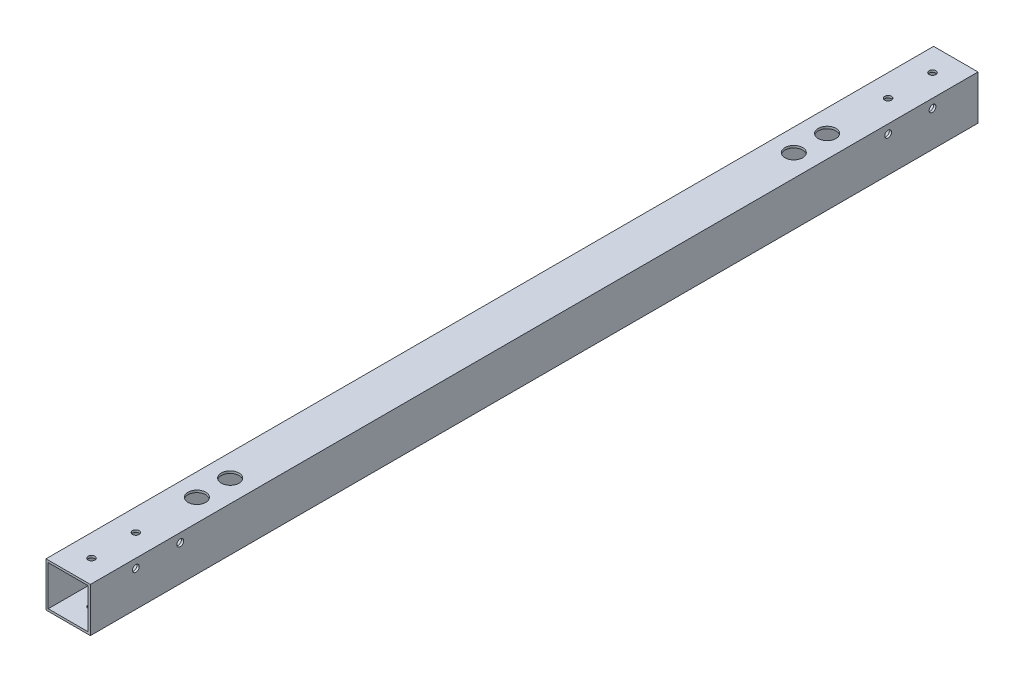
ISO-10303-21;
HEADER;
FILE_DESCRIPTION(('STEP AP214'),'2;1');
FILE_NAME('part.step','',(''),(''),'','','');
FILE_SCHEMA(('AUTOMOTIVE_DESIGN { 1 0 10303 214 1 1 1 1 }'));
ENDSEC;
DATA;
#1=APPLICATION_CONTEXT('core data for automotive mechanical design processes');
#2=APPLICATION_PROTOCOL_DEFINITION('international standard','automotive_design',2000,#1);
#3=PRODUCT_CONTEXT('',#1,'mechanical');
#4=PRODUCT('Part','Part','',(#3));
#5=PRODUCT_RELATED_PRODUCT_CATEGORY('part','',(#4));
#6=PRODUCT_DEFINITION_FORMATION('','',#4);
#7=PRODUCT_DEFINITION_CONTEXT('part definition',#1,'design');
#8=PRODUCT_DEFINITION('design','',#6,#7);
#9=PRODUCT_DEFINITION_SHAPE('','',#8);
#10=(LENGTH_UNIT() NAMED_UNIT(*) SI_UNIT(.MILLI.,.METRE.));
#11=(NAMED_UNIT(*) PLANE_ANGLE_UNIT() SI_UNIT($,.RADIAN.));
#12=(NAMED_UNIT(*) SI_UNIT($,.STERADIAN.) SOLID_ANGLE_UNIT());
#13=UNCERTAINTY_MEASURE_WITH_UNIT(LENGTH_MEASURE(1.E-05),#10,'distance_accuracy_value','');
#14=(GEOMETRIC_REPRESENTATION_CONTEXT(3) GLOBAL_UNCERTAINTY_ASSIGNED_CONTEXT((#13)) GLOBAL_UNIT_ASSIGNED_CONTEXT((#10,
#11,#12)) REPRESENTATION_CONTEXT('',''));
#15=CARTESIAN_POINT('',(0.,0.,0.));
#16=DIRECTION('',(0.,0.,1.));
#17=DIRECTION('',(1.,0.,0.));
#18=AXIS2_PLACEMENT_3D('',#15,#16,#17);
#19=CARTESIAN_POINT('',(10.,-10.,200.));
#20=DIRECTION('',(-1.,0.,0.));
#21=DIRECTION('',(0.,0.,1.));
#22=AXIS2_PLACEMENT_3D('',#19,#20,#21);
#23=PLANE('',#22);
#24=CARTESIAN_POINT('',(10.,5.99999999999989,-179.500000000004));
#25=DIRECTION('',(-1.,0.,0.));
#26=DIRECTION('',(0.,0.,1.));
#27=AXIS2_PLACEMENT_3D('',#24,#25,#26);
#28=CIRCLE('',#27,1.52500000000383);
#29=CARTESIAN_POINT('',(10.,5.99999999999989,-177.975));
#30=VERTEX_POINT('',#29);
#31=EDGE_CURVE('E216',#30,#30,#28,.T.);
#32=ORIENTED_EDGE('',*,*,#31,.T.);
#33=EDGE_LOOP('',(#32));
#34=FACE_BOUND('',#33,.T.);
#35=CARTESIAN_POINT('',(10.,5.99999999999989,-159.500000000004));
#36=DIRECTION('',(-1.,0.,0.));
#37=DIRECTION('',(0.,0.,1.));
#38=AXIS2_PLACEMENT_3D('',#35,#36,#37);
#39=CIRCLE('',#38,1.52500000000383);
#40=CARTESIAN_POINT('',(10.,5.99999999999989,-157.975));
#41=VERTEX_POINT('',#40);
#42=EDGE_CURVE('E226',#41,#41,#39,.T.);
#43=ORIENTED_EDGE('',*,*,#42,.T.);
#44=EDGE_LOOP('',(#43));
#45=FACE_BOUND('',#44,.T.);
#46=CARTESIAN_POINT('',(10.,5.99999999999989,179.500000000004));
#47=DIRECTION('',(1.,0.,0.));
#48=DIRECTION('',(0.,0.,-1.));
#49=AXIS2_PLACEMENT_3D('',#46,#47,#48);
#50=CIRCLE('',#49,1.52500000000383);
#51=CARTESIAN_POINT('',(10.,5.99999999999989,177.975));
#52=VERTEX_POINT('',#51);
#53=EDGE_CURVE('E267',#52,#52,#50,.T.);
#54=ORIENTED_EDGE('',*,*,#53,.F.);
#55=EDGE_LOOP('',(#54));
#56=FACE_BOUND('',#55,.T.);
#57=CARTESIAN_POINT('',(10.,5.99999999999989,159.500000000004));
#58=DIRECTION('',(1.,0.,0.));
#59=DIRECTION('',(0.,0.,-1.));
#60=AXIS2_PLACEMENT_3D('',#57,#58,#59);
#61=CIRCLE('',#60,1.52500000000383);
#62=CARTESIAN_POINT('',(10.,5.99999999999989,157.975));
#63=VERTEX_POINT('',#62);
#64=EDGE_CURVE('E270',#63,#63,#61,.T.);
#65=ORIENTED_EDGE('',*,*,#64,.F.);
#66=EDGE_LOOP('',(#65));
#67=FACE_BOUND('',#66,.T.);
#68=DIRECTION('',(0.,1.,0.));
#69=VECTOR('',#68,1.);
#70=CARTESIAN_POINT('',(10.,-10.,-200.));
#71=LINE('',#70,#69);
#72=CARTESIAN_POINT('',(10.,-10.,-200.));
#73=VERTEX_POINT('',#72);
#74=CARTESIAN_POINT('',(10.,10.,-200.));
#75=VERTEX_POINT('',#74);
#76=EDGE_CURVE('E135',#73,#75,#71,.T.);
#77=ORIENTED_EDGE('',*,*,#76,.T.);
#78=DIRECTION('',(0.,0.,-1.));
#79=VECTOR('',#78,1.);
#80=CARTESIAN_POINT('',(10.,10.,200.));
#81=LINE('',#80,#79);
#82=CARTESIAN_POINT('',(10.,10.,200.));
#83=VERTEX_POINT('',#82);
#84=EDGE_CURVE('E11',#83,#75,#81,.T.);
#85=ORIENTED_EDGE('',*,*,#84,.F.);
#86=DIRECTION('',(0.,1.,0.));
#87=VECTOR('',#86,1.);
#88=CARTESIAN_POINT('',(10.,-10.,200.));
#89=LINE('',#88,#87);
#90=CARTESIAN_POINT('',(10.,-10.,200.));
#91=VERTEX_POINT('',#90);
#92=EDGE_CURVE('E138',#91,#83,#89,.T.);
#93=ORIENTED_EDGE('',*,*,#92,.F.);
#94=DIRECTION('',(0.,0.,-1.));
#95=VECTOR('',#94,1.);
#96=CARTESIAN_POINT('',(10.,-10.,200.));
#97=LINE('',#96,#95);
#98=EDGE_CURVE('E148',#91,#73,#97,.T.);
#99=ORIENTED_EDGE('',*,*,#98,.T.);
#100=EDGE_LOOP('',(#77,#85,#93,#99));
#101=FACE_BOUND('',#100,.T.);
#102=ADVANCED_FACE('F35',(#34,#45,#56,#67,#101),#23,.F.);
#103=CARTESIAN_POINT('',(-9.99999999999999,10.,200.));
#104=DIRECTION('',(0.,-1.,0.));
#105=DIRECTION('',(0.,0.,-1.));
#106=AXIS2_PLACEMENT_3D('',#103,#104,#105);
#107=PLANE('',#106);
#108=CARTESIAN_POINT('',(0.,10.,-127.));
#109=DIRECTION('',(0.,-1.,0.));
#110=DIRECTION('',(0.,0.,-1.));
#111=AXIS2_PLACEMENT_3D('',#108,#109,#110);
#112=CIRCLE('',#111,4.);
#113=CARTESIAN_POINT('',(0.,10.,-131.));
#114=VERTEX_POINT('',#113);
#115=EDGE_CURVE('E204',#114,#114,#112,.T.);
#116=ORIENTED_EDGE('',*,*,#115,.T.);
#117=EDGE_LOOP('',(#116));
#118=FACE_BOUND('',#117,.T.);
#119=CARTESIAN_POINT('',(0.,10.,-142.));
#120=DIRECTION('',(0.,-1.,0.));
#121=DIRECTION('',(0.,0.,-1.));
#122=AXIS2_PLACEMENT_3D('',#119,#120,#121);
#123=CIRCLE('',#122,4.);
#124=CARTESIAN_POINT('',(0.,10.,-146.));
#125=VERTEX_POINT('',#124);
#126=EDGE_CURVE('E232',#125,#125,#123,.T.);
#127=ORIENTED_EDGE('',*,*,#126,.T.);
#128=EDGE_LOOP('',(#127));
#129=FACE_BOUND('',#128,.T.);
#130=CARTESIAN_POINT('',(0.,10.,127.));
#131=DIRECTION('',(0.,1.,0.));
#132=DIRECTION('',(0.,0.,1.));
#133=AXIS2_PLACEMENT_3D('',#130,#131,#132);
#134=CIRCLE('',#133,4.);
#135=CARTESIAN_POINT('',(0.,10.,131.));
#136=VERTEX_POINT('',#135);
#137=EDGE_CURVE('E196',#136,#136,#134,.T.);
#138=ORIENTED_EDGE('',*,*,#137,.F.);
#139=EDGE_LOOP('',(#138));
#140=FACE_BOUND('',#139,.T.);
#141=CARTESIAN_POINT('',(0.,10.,142.));
#142=DIRECTION('',(0.,1.,0.));
#143=DIRECTION('',(0.,0.,1.));
#144=AXIS2_PLACEMENT_3D('',#141,#142,#143);
#145=CIRCLE('',#144,4.);
#146=CARTESIAN_POINT('',(0.,10.,146.));
#147=VERTEX_POINT('',#146);
#148=EDGE_CURVE('E248',#147,#147,#145,.T.);
#149=ORIENTED_EDGE('',*,*,#148,.F.);
#150=EDGE_LOOP('',(#149));
#151=FACE_BOUND('',#150,.T.);
#152=CARTESIAN_POINT('',(0.,10.,-189.5));
#153=DIRECTION('',(0.,-1.,0.));
#154=DIRECTION('',(0.,0.,-1.));
#155=AXIS2_PLACEMENT_3D('',#152,#153,#154);
#156=CIRCLE('',#155,1.52500000000002);
#157=CARTESIAN_POINT('',(0.,10.,-191.025));
#158=VERTEX_POINT('',#157);
#159=EDGE_CURVE('E290',#158,#158,#156,.F.);
#160=ORIENTED_EDGE('',*,*,#159,.F.);
#161=EDGE_LOOP('',(#160));
#162=FACE_BOUND('',#161,.T.);
#163=CARTESIAN_POINT('',(0.,10.,-169.5));
#164=DIRECTION('',(0.,-1.,0.));
#165=DIRECTION('',(0.,0.,-1.));
#166=AXIS2_PLACEMENT_3D('',#163,#164,#165);
#167=CIRCLE('',#166,1.52500000000002);
#168=CARTESIAN_POINT('',(0.,10.,-171.025));
#169=VERTEX_POINT('',#168);
#170=EDGE_CURVE('E182',#169,#169,#167,.F.);
#171=ORIENTED_EDGE('',*,*,#170,.F.);
#172=EDGE_LOOP('',(#171));
#173=FACE_BOUND('',#172,.T.);
#174=CARTESIAN_POINT('',(0.,10.,189.5));
#175=DIRECTION('',(0.,-1.,0.));
#176=DIRECTION('',(0.,0.,-1.));
#177=AXIS2_PLACEMENT_3D('',#174,#175,#176);
#178=CIRCLE('',#177,1.52500000000002);
#179=CARTESIAN_POINT('',(0.,10.,187.975));
#180=VERTEX_POINT('',#179);
#181=EDGE_CURVE('E304',#180,#180,#178,.T.);
#182=ORIENTED_EDGE('',*,*,#181,.T.);
#183=EDGE_LOOP('',(#182));
#184=FACE_BOUND('',#183,.T.);
#185=CARTESIAN_POINT('',(0.,10.,169.5));
#186=DIRECTION('',(0.,-1.,0.));
#187=DIRECTION('',(0.,0.,-1.));
#188=AXIS2_PLACEMENT_3D('',#185,#186,#187);
#189=CIRCLE('',#188,1.52500000000002);
#190=CARTESIAN_POINT('',(0.,10.,167.975));
#191=VERTEX_POINT('',#190);
#192=EDGE_CURVE('E172',#191,#191,#189,.T.);
#193=ORIENTED_EDGE('',*,*,#192,.T.);
#194=EDGE_LOOP('',(#193));
#195=FACE_BOUND('',#194,.T.);
#196=DIRECTION('',(-1.,0.,0.));
#197=VECTOR('',#196,1.);
#198=CARTESIAN_POINT('',(-9.99999999999999,10.,-200.));
#199=LINE('',#198,#197);
#200=CARTESIAN_POINT('',(-9.99999999999999,10.,-200.));
#201=VERTEX_POINT('',#200);
#202=EDGE_CURVE('E151',#75,#201,#199,.T.);
#203=ORIENTED_EDGE('',*,*,#202,.T.);
#204=DIRECTION('',(0.,0.,-1.));
#205=VECTOR('',#204,1.);
#206=CARTESIAN_POINT('',(-9.99999999999999,10.,200.));
#207=LINE('',#206,#205);
#208=CARTESIAN_POINT('',(-9.99999999999999,10.,200.));
#209=VERTEX_POINT('',#208);
#210=EDGE_CURVE('E43',#209,#201,#207,.T.);
#211=ORIENTED_EDGE('',*,*,#210,.F.);
#212=DIRECTION('',(-1.,0.,0.));
#213=VECTOR('',#212,1.);
#214=CARTESIAN_POINT('',(-9.99999999999999,10.,200.));
#215=LINE('',#214,#213);
#216=EDGE_CURVE('E141',#83,#209,#215,.T.);
#217=ORIENTED_EDGE('',*,*,#216,.F.);
#218=ORIENTED_EDGE('',*,*,#84,.T.);
#219=EDGE_LOOP('',(#203,#211,#217,#218));
#220=FACE_BOUND('',#219,.T.);
#221=ADVANCED_FACE('F308',(#118,#129,#140,#151,#162,#173,#184,#195,#220),#107,.F.);
#222=CARTESIAN_POINT('',(-9.99999999999999,-10.,200.));
#223=DIRECTION('',(1.,0.,0.));
#224=DIRECTION('',(0.,0.,-1.));
#225=AXIS2_PLACEMENT_3D('',#222,#223,#224);
#226=PLANE('',#225);
#227=CARTESIAN_POINT('',(-9.99999999999999,5.99999999999989,-179.500000000004));
#228=DIRECTION('',(-1.,0.,0.));
#229=DIRECTION('',(0.,0.,1.));
#230=AXIS2_PLACEMENT_3D('',#227,#228,#229);
#231=CIRCLE('',#230,1.52500000000383);
#232=CARTESIAN_POINT('',(-9.99999999999999,5.99999999999989,-177.975));
#233=VERTEX_POINT('',#232);
#234=EDGE_CURVE('E210',#233,#233,#231,.T.);
#235=ORIENTED_EDGE('',*,*,#234,.F.);
#236=EDGE_LOOP('',(#235));
#237=FACE_BOUND('',#236,.T.);
#238=CARTESIAN_POINT('',(-9.99999999999999,5.99999999999989,-159.500000000004));
#239=DIRECTION('',(-1.,0.,0.));
#240=DIRECTION('',(0.,0.,1.));
#241=AXIS2_PLACEMENT_3D('',#238,#239,#240);
#242=CIRCLE('',#241,1.52500000000383);
#243=CARTESIAN_POINT('',(-9.99999999999999,5.99999999999989,-157.975));
#244=VERTEX_POINT('',#243);
#245=EDGE_CURVE('E221',#244,#244,#242,.T.);
#246=ORIENTED_EDGE('',*,*,#245,.F.);
#247=EDGE_LOOP('',(#246));
#248=FACE_BOUND('',#247,.T.);
#249=CARTESIAN_POINT('',(-9.99999999999999,5.99999999999989,179.500000000004));
#250=DIRECTION('',(1.,0.,0.));
#251=DIRECTION('',(0.,0.,-1.));
#252=AXIS2_PLACEMENT_3D('',#249,#250,#251);
#253=CIRCLE('',#252,1.52500000000383);
#254=CARTESIAN_POINT('',(-9.99999999999999,5.99999999999989,177.975));
#255=VERTEX_POINT('',#254);
#256=EDGE_CURVE('E187',#255,#255,#253,.T.);
#257=ORIENTED_EDGE('',*,*,#256,.T.);
#258=EDGE_LOOP('',(#257));
#259=FACE_BOUND('',#258,.T.);
#260=CARTESIAN_POINT('',(-9.99999999999999,5.99999999999989,159.500000000004));
#261=DIRECTION('',(1.,0.,0.));
#262=DIRECTION('',(0.,0.,-1.));
#263=AXIS2_PLACEMENT_3D('',#260,#261,#262);
#264=CIRCLE('',#263,1.52500000000383);
#265=CARTESIAN_POINT('',(-9.99999999999999,5.99999999999989,157.975));
#266=VERTEX_POINT('',#265);
#267=EDGE_CURVE('E264',#266,#266,#264,.T.);
#268=ORIENTED_EDGE('',*,*,#267,.T.);
#269=EDGE_LOOP('',(#268));
#270=FACE_BOUND('',#269,.T.);
#271=DIRECTION('',(0.,-1.,0.));
#272=VECTOR('',#271,1.);
#273=CARTESIAN_POINT('',(-9.99999999999999,-10.,-200.));
#274=LINE('',#273,#272);
#275=CARTESIAN_POINT('',(-9.99999999999999,-10.,-200.));
#276=VERTEX_POINT('',#275);
#277=EDGE_CURVE('E153',#201,#276,#274,.T.);
#278=ORIENTED_EDGE('',*,*,#277,.T.);
#279=DIRECTION('',(0.,0.,-1.));
#280=VECTOR('',#279,1.);
#281=CARTESIAN_POINT('',(-9.99999999999999,-10.,200.));
#282=LINE('',#281,#280);
#283=CARTESIAN_POINT('',(-9.99999999999999,-10.,200.));
#284=VERTEX_POINT('',#283);
#285=EDGE_CURVE('E158',#284,#276,#282,.T.);
#286=ORIENTED_EDGE('',*,*,#285,.F.);
#287=DIRECTION('',(0.,-1.,0.));
#288=VECTOR('',#287,1.);
#289=CARTESIAN_POINT('',(-9.99999999999999,-10.,200.));
#290=LINE('',#289,#288);
#291=EDGE_CURVE('E144',#209,#284,#290,.T.);
#292=ORIENTED_EDGE('',*,*,#291,.F.);
#293=ORIENTED_EDGE('',*,*,#210,.T.);
#294=EDGE_LOOP('',(#278,#286,#292,#293));
#295=FACE_BOUND('',#294,.T.);
#296=ADVANCED_FACE('F335',(#237,#248,#259,#270,#295),#226,.F.);
#297=CARTESIAN_POINT('',(-9.99999999999999,-10.,200.));
#298=DIRECTION('',(0.,1.,0.));
#299=DIRECTION('',(0.,0.,1.));
#300=AXIS2_PLACEMENT_3D('',#297,#298,#299);
#301=PLANE('',#300);
#302=CARTESIAN_POINT('',(0.,-10.,-142.));
#303=DIRECTION('',(0.,1.,0.));
#304=DIRECTION('',(0.,0.,1.));
#305=AXIS2_PLACEMENT_3D('',#302,#303,#304);
#306=CIRCLE('',#305,2.025);
#307=CARTESIAN_POINT('',(0.,-10.,-139.975));
#308=VERTEX_POINT('',#307);
#309=EDGE_CURVE('E237',#308,#308,#306,.T.);
#310=ORIENTED_EDGE('',*,*,#309,.T.);
#311=EDGE_LOOP('',(#310));
#312=FACE_BOUND('',#311,.T.);
#313=CARTESIAN_POINT('',(0.,-10.,-127.));
#314=DIRECTION('',(0.,1.,0.));
#315=DIRECTION('',(0.,0.,1.));
#316=AXIS2_PLACEMENT_3D('',#313,#314,#315);
#317=CIRCLE('',#316,2.025);
#318=CARTESIAN_POINT('',(0.,-10.,-124.975));
#319=VERTEX_POINT('',#318);
#320=EDGE_CURVE('E206',#319,#319,#317,.T.);
#321=ORIENTED_EDGE('',*,*,#320,.T.);
#322=EDGE_LOOP('',(#321));
#323=FACE_BOUND('',#322,.T.);
#324=CARTESIAN_POINT('',(0.,-10.,142.));
#325=DIRECTION('',(0.,-1.,0.));
#326=DIRECTION('',(0.,0.,-1.));
#327=AXIS2_PLACEMENT_3D('',#324,#325,#326);
#328=CIRCLE('',#327,2.025);
#329=CARTESIAN_POINT('',(0.,-10.,139.975));
#330=VERTEX_POINT('',#329);
#331=EDGE_CURVE('E253',#330,#330,#328,.T.);
#332=ORIENTED_EDGE('',*,*,#331,.F.);
#333=EDGE_LOOP('',(#332));
#334=FACE_BOUND('',#333,.T.);
#335=CARTESIAN_POINT('',(0.,-10.,127.));
#336=DIRECTION('',(0.,-1.,0.));
#337=DIRECTION('',(0.,0.,-1.));
#338=AXIS2_PLACEMENT_3D('',#335,#336,#337);
#339=CIRCLE('',#338,2.025);
#340=CARTESIAN_POINT('',(0.,-10.,124.975));
#341=VERTEX_POINT('',#340);
#342=EDGE_CURVE('E199',#341,#341,#339,.T.);
#343=ORIENTED_EDGE('',*,*,#342,.F.);
#344=EDGE_LOOP('',(#343));
#345=FACE_BOUND('',#344,.T.);
#346=CARTESIAN_POINT('',(0.,-10.,-189.5));
#347=DIRECTION('',(0.,-1.,0.));
#348=DIRECTION('',(0.,0.,-1.));
#349=AXIS2_PLACEMENT_3D('',#346,#347,#348);
#350=CIRCLE('',#349,1.52500000000002);
#351=CARTESIAN_POINT('',(0.,-10.,-191.025));
#352=VERTEX_POINT('',#351);
#353=EDGE_CURVE('E177',#352,#352,#350,.T.);
#354=ORIENTED_EDGE('',*,*,#353,.F.);
#355=EDGE_LOOP('',(#354));
#356=FACE_BOUND('',#355,.T.);
#357=CARTESIAN_POINT('',(0.,-10.,-169.5));
#358=DIRECTION('',(0.,-1.,0.));
#359=DIRECTION('',(0.,0.,-1.));
#360=AXIS2_PLACEMENT_3D('',#357,#358,#359);
#361=CIRCLE('',#360,1.52500000000002);
#362=CARTESIAN_POINT('',(0.,-10.,-171.025));
#363=VERTEX_POINT('',#362);
#364=EDGE_CURVE('E279',#363,#363,#361,.T.);
#365=ORIENTED_EDGE('',*,*,#364,.F.);
#366=EDGE_LOOP('',(#365));
#367=FACE_BOUND('',#366,.T.);
#368=CARTESIAN_POINT('',(0.,-10.,189.5));
#369=DIRECTION('',(0.,1.,0.));
#370=DIRECTION('',(0.,0.,1.));
#371=AXIS2_PLACEMENT_3D('',#368,#369,#370);
#372=CIRCLE('',#371,1.52500000000002);
#373=CARTESIAN_POINT('',(0.,-10.,191.025));
#374=VERTEX_POINT('',#373);
#375=EDGE_CURVE('E167',#374,#374,#372,.T.);
#376=ORIENTED_EDGE('',*,*,#375,.T.);
#377=EDGE_LOOP('',(#376));
#378=FACE_BOUND('',#377,.T.);
#379=CARTESIAN_POINT('',(0.,-10.,169.5));
#380=DIRECTION('',(0.,1.,0.));
#381=DIRECTION('',(0.,0.,1.));
#382=AXIS2_PLACEMENT_3D('',#379,#380,#381);
#383=CIRCLE('',#382,1.52500000000002);
#384=CARTESIAN_POINT('',(0.,-10.,171.025));
#385=VERTEX_POINT('',#384);
#386=EDGE_CURVE('E293',#385,#385,#383,.T.);
#387=ORIENTED_EDGE('',*,*,#386,.T.);
#388=EDGE_LOOP('',(#387));
#389=FACE_BOUND('',#388,.T.);
#390=DIRECTION('',(1.,0.,0.));
#391=VECTOR('',#390,1.);
#392=CARTESIAN_POINT('',(-9.99999999999999,-10.,-200.));
#393=LINE('',#392,#391);
#394=EDGE_CURVE('E142',#276,#73,#393,.T.);
#395=ORIENTED_EDGE('',*,*,#394,.T.);
#396=ORIENTED_EDGE('',*,*,#98,.F.);
#397=DIRECTION('',(1.,0.,0.));
#398=VECTOR('',#397,1.);
#399=CARTESIAN_POINT('',(-9.99999999999999,-10.,200.));
#400=LINE('',#399,#398);
#401=EDGE_CURVE('E146',#284,#91,#400,.T.);
#402=ORIENTED_EDGE('',*,*,#401,.F.);
#403=ORIENTED_EDGE('',*,*,#285,.T.);
#404=EDGE_LOOP('',(#395,#396,#402,#403));
#405=FACE_BOUND('',#404,.T.);
#406=ADVANCED_FACE('F359',(#312,#323,#334,#345,#356,#367,#378,#389,#405),#301,.F.);
#407=CARTESIAN_POINT('',(0.,0.,200.));
#408=DIRECTION('',(0.,0.,-1.));
#409=DIRECTION('',(-1.,0.,0.));
#410=AXIS2_PLACEMENT_3D('',#407,#408,#409);
#411=PLANE('',#410);
#412=DIRECTION('',(0.,1.,0.));
#413=VECTOR('',#412,1.);
#414=CARTESIAN_POINT('',(9.00000000000001,-9.,200.));
#415=LINE('',#414,#413);
#416=CARTESIAN_POINT('',(9.00000000000001,-9.,200.));
#417=VERTEX_POINT('',#416);
#418=CARTESIAN_POINT('',(9.00000000000001,9.,200.));
#419=VERTEX_POINT('',#418);
#420=EDGE_CURVE('E112',#417,#419,#415,.T.);
#421=ORIENTED_EDGE('',*,*,#420,.F.);
#422=DIRECTION('',(1.,0.,0.));
#423=VECTOR('',#422,1.);
#424=CARTESIAN_POINT('',(-8.99999999999999,-9.,200.));
#425=LINE('',#424,#423);
#426=CARTESIAN_POINT('',(-8.99999999999999,-9.,200.));
#427=VERTEX_POINT('',#426);
#428=EDGE_CURVE('E51',#427,#417,#425,.T.);
#429=ORIENTED_EDGE('',*,*,#428,.F.);
#430=DIRECTION('',(0.,-1.,0.));
#431=VECTOR('',#430,1.);
#432=CARTESIAN_POINT('',(-8.99999999999999,9.,200.));
#433=LINE('',#432,#431);
#434=CARTESIAN_POINT('',(-8.99999999999999,9.,200.));
#435=VERTEX_POINT('',#434);
#436=EDGE_CURVE('E119',#435,#427,#433,.T.);
#437=ORIENTED_EDGE('',*,*,#436,.F.);
#438=DIRECTION('',(-1.,0.,0.));
#439=VECTOR('',#438,1.);
#440=CARTESIAN_POINT('',(9.00000000000001,9.,200.));
#441=LINE('',#440,#439);
#442=EDGE_CURVE('E103',#419,#435,#441,.T.);
#443=ORIENTED_EDGE('',*,*,#442,.F.);
#444=EDGE_LOOP('',(#421,#429,#437,#443));
#445=FACE_BOUND('',#444,.T.);
#446=ORIENTED_EDGE('',*,*,#92,.T.);
#447=ORIENTED_EDGE('',*,*,#216,.T.);
#448=ORIENTED_EDGE('',*,*,#291,.T.);
#449=ORIENTED_EDGE('',*,*,#401,.T.);
#450=EDGE_LOOP('',(#446,#447,#448,#449));
#451=FACE_BOUND('',#450,.T.);
#452=ADVANCED_FACE('F116',(#445,#451),#411,.F.);
#453=CARTESIAN_POINT('',(0.,0.,-200.));
#454=DIRECTION('',(0.,0.,-1.));
#455=DIRECTION('',(-1.,0.,0.));
#456=AXIS2_PLACEMENT_3D('',#453,#454,#455);
#457=PLANE('',#456);
#458=DIRECTION('',(1.,0.,0.));
#459=VECTOR('',#458,1.);
#460=CARTESIAN_POINT('',(-8.99999999999999,-9.,-200.));
#461=LINE('',#460,#459);
#462=CARTESIAN_POINT('',(-8.99999999999999,-9.,-200.));
#463=VERTEX_POINT('',#462);
#464=CARTESIAN_POINT('',(9.00000000000001,-9.,-200.));
#465=VERTEX_POINT('',#464);
#466=EDGE_CURVE('E121',#463,#465,#461,.T.);
#467=ORIENTED_EDGE('',*,*,#466,.T.);
#468=DIRECTION('',(0.,1.,0.));
#469=VECTOR('',#468,1.);
#470=CARTESIAN_POINT('',(9.00000000000001,-9.,-200.));
#471=LINE('',#470,#469);
#472=CARTESIAN_POINT('',(9.00000000000001,9.,-200.));
#473=VERTEX_POINT('',#472);
#474=EDGE_CURVE('E127',#465,#473,#471,.T.);
#475=ORIENTED_EDGE('',*,*,#474,.T.);
#476=DIRECTION('',(-1.,0.,0.));
#477=VECTOR('',#476,1.);
#478=CARTESIAN_POINT('',(9.00000000000001,9.,-200.));
#479=LINE('',#478,#477);
#480=CARTESIAN_POINT('',(-8.99999999999999,9.,-200.));
#481=VERTEX_POINT('',#480);
#482=EDGE_CURVE('E59',#473,#481,#479,.T.);
#483=ORIENTED_EDGE('',*,*,#482,.T.);
#484=DIRECTION('',(0.,-1.,0.));
#485=VECTOR('',#484,1.);
#486=CARTESIAN_POINT('',(-8.99999999999999,9.,-200.));
#487=LINE('',#486,#485);
#488=EDGE_CURVE('E130',#481,#463,#487,.T.);
#489=ORIENTED_EDGE('',*,*,#488,.T.);
#490=EDGE_LOOP('',(#467,#475,#483,#489));
#491=FACE_BOUND('',#490,.T.);
#492=ORIENTED_EDGE('',*,*,#76,.F.);
#493=ORIENTED_EDGE('',*,*,#394,.F.);
#494=ORIENTED_EDGE('',*,*,#277,.F.);
#495=ORIENTED_EDGE('',*,*,#202,.F.);
#496=EDGE_LOOP('',(#492,#493,#494,#495));
#497=FACE_BOUND('',#496,.T.);
#498=ADVANCED_FACE('F351',(#491,#497),#457,.T.);
#499=CARTESIAN_POINT('',(-8.99999999999999,-9.,-200.));
#500=DIRECTION('',(0.,-1.,0.));
#501=DIRECTION('',(0.,0.,-1.));
#502=AXIS2_PLACEMENT_3D('',#499,#500,#501);
#503=PLANE('',#502);
#504=CARTESIAN_POINT('',(0.,-9.,-142.));
#505=DIRECTION('',(0.,-1.,0.));
#506=DIRECTION('',(0.,0.,-1.));
#507=AXIS2_PLACEMENT_3D('',#504,#505,#506);
#508=CIRCLE('',#507,2.025);
#509=CARTESIAN_POINT('',(0.,-9.,-144.025));
#510=VERTEX_POINT('',#509);
#511=EDGE_CURVE('E245',#510,#510,#508,.F.);
#512=ORIENTED_EDGE('',*,*,#511,.F.);
#513=EDGE_LOOP('',(#512));
#514=FACE_BOUND('',#513,.T.);
#515=CARTESIAN_POINT('',(0.,-9.,-127.));
#516=DIRECTION('',(0.,-1.,0.));
#517=DIRECTION('',(0.,0.,-1.));
#518=AXIS2_PLACEMENT_3D('',#515,#516,#517);
#519=CIRCLE('',#518,2.025);
#520=CARTESIAN_POINT('',(0.,-9.,-129.025));
#521=VERTEX_POINT('',#520);
#522=EDGE_CURVE('E240',#521,#521,#519,.F.);
#523=ORIENTED_EDGE('',*,*,#522,.F.);
#524=EDGE_LOOP('',(#523));
#525=FACE_BOUND('',#524,.T.);
#526=CARTESIAN_POINT('',(0.,-9.,142.));
#527=DIRECTION('',(0.,-1.,0.));
#528=DIRECTION('',(0.,0.,-1.));
#529=AXIS2_PLACEMENT_3D('',#526,#527,#528);
#530=CIRCLE('',#529,2.025);
#531=CARTESIAN_POINT('',(0.,-9.,139.975));
#532=VERTEX_POINT('',#531);
#533=EDGE_CURVE('E261',#532,#532,#530,.T.);
#534=ORIENTED_EDGE('',*,*,#533,.T.);
#535=EDGE_LOOP('',(#534));
#536=FACE_BOUND('',#535,.T.);
#537=CARTESIAN_POINT('',(0.,-9.,127.));
#538=DIRECTION('',(0.,-1.,0.));
#539=DIRECTION('',(0.,0.,-1.));
#540=AXIS2_PLACEMENT_3D('',#537,#538,#539);
#541=CIRCLE('',#540,2.025);
#542=CARTESIAN_POINT('',(0.,-9.,124.975));
#543=VERTEX_POINT('',#542);
#544=EDGE_CURVE('E256',#543,#543,#541,.T.);
#545=ORIENTED_EDGE('',*,*,#544,.T.);
#546=EDGE_LOOP('',(#545));
#547=FACE_BOUND('',#546,.T.);
#548=CARTESIAN_POINT('',(0.,-9.,-189.5));
#549=DIRECTION('',(0.,-1.,0.));
#550=DIRECTION('',(0.,0.,-1.));
#551=AXIS2_PLACEMENT_3D('',#548,#549,#550);
#552=CIRCLE('',#551,1.52500000000002);
#553=CARTESIAN_POINT('',(0.,-9.,-191.025));
#554=VERTEX_POINT('',#553);
#555=EDGE_CURVE('E181',#554,#554,#552,.F.);
#556=ORIENTED_EDGE('',*,*,#555,.F.);
#557=EDGE_LOOP('',(#556));
#558=FACE_BOUND('',#557,.T.);
#559=CARTESIAN_POINT('',(0.,-9.,-169.5));
#560=DIRECTION('',(0.,-1.,0.));
#561=DIRECTION('',(0.,0.,-1.));
#562=AXIS2_PLACEMENT_3D('',#559,#560,#561);
#563=CIRCLE('',#562,1.52500000000002);
#564=CARTESIAN_POINT('',(0.,-9.,-171.025));
#565=VERTEX_POINT('',#564);
#566=EDGE_CURVE('E176',#565,#565,#563,.F.);
#567=ORIENTED_EDGE('',*,*,#566,.F.);
#568=EDGE_LOOP('',(#567));
#569=FACE_BOUND('',#568,.T.);
#570=CARTESIAN_POINT('',(0.,-9.,189.5));
#571=DIRECTION('',(0.,-1.,0.));
#572=DIRECTION('',(0.,0.,-1.));
#573=AXIS2_PLACEMENT_3D('',#570,#571,#572);
#574=CIRCLE('',#573,1.52500000000002);
#575=CARTESIAN_POINT('',(0.,-9.,187.975));
#576=VERTEX_POINT('',#575);
#577=EDGE_CURVE('E171',#576,#576,#574,.T.);
#578=ORIENTED_EDGE('',*,*,#577,.T.);
#579=EDGE_LOOP('',(#578));
#580=FACE_BOUND('',#579,.T.);
#581=CARTESIAN_POINT('',(0.,-9.,169.5));
#582=DIRECTION('',(0.,-1.,0.));
#583=DIRECTION('',(0.,0.,-1.));
#584=AXIS2_PLACEMENT_3D('',#581,#582,#583);
#585=CIRCLE('',#584,1.52500000000002);
#586=CARTESIAN_POINT('',(0.,-9.,167.975));
#587=VERTEX_POINT('',#586);
#588=EDGE_CURVE('E166',#587,#587,#585,.T.);
#589=ORIENTED_EDGE('',*,*,#588,.T.);
#590=EDGE_LOOP('',(#589));
#591=FACE_BOUND('',#590,.T.);
#592=DIRECTION('',(0.,0.,1.));
#593=VECTOR('',#592,1.);
#594=CARTESIAN_POINT('',(9.00000000000001,-9.,-200.));
#595=LINE('',#594,#593);
#596=EDGE_CURVE('E109',#465,#417,#595,.T.);
#597=ORIENTED_EDGE('',*,*,#596,.F.);
#598=ORIENTED_EDGE('',*,*,#466,.F.);
#599=DIRECTION('',(0.,0.,1.));
#600=VECTOR('',#599,1.);
#601=CARTESIAN_POINT('',(-8.99999999999999,-9.,-200.));
#602=LINE('',#601,#600);
#603=EDGE_CURVE('E133',#463,#427,#602,.T.);
#604=ORIENTED_EDGE('',*,*,#603,.T.);
#605=ORIENTED_EDGE('',*,*,#428,.T.);
#606=EDGE_LOOP('',(#597,#598,#604,#605));
#607=FACE_BOUND('',#606,.T.);
#608=ADVANCED_FACE('F373',(#514,#525,#536,#547,#558,#569,#580,#591,#607),#503,.F.);
#609=CARTESIAN_POINT('',(-8.99999999999999,9.,-200.));
#610=DIRECTION('',(-1.,0.,0.));
#611=DIRECTION('',(0.,0.,1.));
#612=AXIS2_PLACEMENT_3D('',#609,#610,#611);
#613=PLANE('',#612);
#614=CARTESIAN_POINT('',(-8.99999999999999,5.99999999999989,-179.500000000004));
#615=DIRECTION('',(-1.,0.,0.));
#616=DIRECTION('',(0.,0.,1.));
#617=AXIS2_PLACEMENT_3D('',#614,#615,#616);
#618=CIRCLE('',#617,1.52500000000383);
#619=CARTESIAN_POINT('',(-8.99999999999999,5.99999999999989,-177.975));
#620=VERTEX_POINT('',#619);
#621=EDGE_CURVE('E229',#620,#620,#618,.F.);
#622=ORIENTED_EDGE('',*,*,#621,.F.);
#623=EDGE_LOOP('',(#622));
#624=FACE_BOUND('',#623,.T.);
#625=CARTESIAN_POINT('',(-8.99999999999999,5.99999999999989,-159.500000000004));
#626=DIRECTION('',(-1.,0.,0.));
#627=DIRECTION('',(0.,0.,1.));
#628=AXIS2_PLACEMENT_3D('',#625,#626,#627);
#629=CIRCLE('',#628,1.52500000000383);
#630=CARTESIAN_POINT('',(-8.99999999999999,5.99999999999989,-157.975));
#631=VERTEX_POINT('',#630);
#632=EDGE_CURVE('E209',#631,#631,#629,.F.);
#633=ORIENTED_EDGE('',*,*,#632,.F.);
#634=EDGE_LOOP('',(#633));
#635=FACE_BOUND('',#634,.T.);
#636=CARTESIAN_POINT('',(-8.99999999999999,5.99999999999989,179.500000000004));
#637=DIRECTION('',(-1.,0.,0.));
#638=DIRECTION('',(0.,0.,1.));
#639=AXIS2_PLACEMENT_3D('',#636,#637,#638);
#640=CIRCLE('',#639,1.52500000000383);
#641=CARTESIAN_POINT('',(-8.99999999999999,5.99999999999989,181.025000000008));
#642=VERTEX_POINT('',#641);
#643=EDGE_CURVE('E191',#642,#642,#640,.T.);
#644=ORIENTED_EDGE('',*,*,#643,.T.);
#645=EDGE_LOOP('',(#644));
#646=FACE_BOUND('',#645,.T.);
#647=CARTESIAN_POINT('',(-8.99999999999999,5.99999999999989,159.500000000004));
#648=DIRECTION('',(-1.,0.,0.));
#649=DIRECTION('',(0.,0.,1.));
#650=AXIS2_PLACEMENT_3D('',#647,#648,#649);
#651=CIRCLE('',#650,1.52500000000383);
#652=CARTESIAN_POINT('',(-8.99999999999999,5.99999999999989,161.025000000008));
#653=VERTEX_POINT('',#652);
#654=EDGE_CURVE('E186',#653,#653,#651,.T.);
#655=ORIENTED_EDGE('',*,*,#654,.T.);
#656=EDGE_LOOP('',(#655));
#657=FACE_BOUND('',#656,.T.);
#658=ORIENTED_EDGE('',*,*,#603,.F.);
#659=ORIENTED_EDGE('',*,*,#488,.F.);
#660=DIRECTION('',(0.,0.,1.));
#661=VECTOR('',#660,1.);
#662=CARTESIAN_POINT('',(-8.99999999999999,9.,-200.));
#663=LINE('',#662,#661);
#664=EDGE_CURVE('E108',#481,#435,#663,.T.);
#665=ORIENTED_EDGE('',*,*,#664,.T.);
#666=ORIENTED_EDGE('',*,*,#436,.T.);
#667=EDGE_LOOP('',(#658,#659,#665,#666));
#668=FACE_BOUND('',#667,.T.);
#669=ADVANCED_FACE('F379',(#624,#635,#646,#657,#668),#613,.F.);
#670=CARTESIAN_POINT('',(9.00000000000001,9.,-200.));
#671=DIRECTION('',(0.,1.,0.));
#672=DIRECTION('',(0.,0.,1.));
#673=AXIS2_PLACEMENT_3D('',#670,#671,#672);
#674=PLANE('',#673);
#675=CARTESIAN_POINT('',(0.,9.,-127.));
#676=DIRECTION('',(0.,1.,0.));
#677=DIRECTION('',(0.,0.,1.));
#678=AXIS2_PLACEMENT_3D('',#675,#676,#677);
#679=CIRCLE('',#678,4.);
#680=CARTESIAN_POINT('',(0.,9.,-123.));
#681=VERTEX_POINT('',#680);
#682=EDGE_CURVE('E203',#681,#681,#679,.F.);
#683=ORIENTED_EDGE('',*,*,#682,.F.);
#684=EDGE_LOOP('',(#683));
#685=FACE_BOUND('',#684,.T.);
#686=CARTESIAN_POINT('',(0.,9.,-142.));
#687=DIRECTION('',(0.,1.,0.));
#688=DIRECTION('',(0.,0.,1.));
#689=AXIS2_PLACEMENT_3D('',#686,#687,#688);
#690=CIRCLE('',#689,4.);
#691=CARTESIAN_POINT('',(0.,9.,-138.));
#692=VERTEX_POINT('',#691);
#693=EDGE_CURVE('E200',#692,#692,#690,.F.);
#694=ORIENTED_EDGE('',*,*,#693,.F.);
#695=EDGE_LOOP('',(#694));
#696=FACE_BOUND('',#695,.T.);
#697=CARTESIAN_POINT('',(0.,9.,127.));
#698=DIRECTION('',(0.,1.,0.));
#699=DIRECTION('',(0.,0.,1.));
#700=AXIS2_PLACEMENT_3D('',#697,#698,#699);
#701=CIRCLE('',#700,4.);
#702=CARTESIAN_POINT('',(0.,9.,131.));
#703=VERTEX_POINT('',#702);
#704=EDGE_CURVE('E195',#703,#703,#701,.T.);
#705=ORIENTED_EDGE('',*,*,#704,.T.);
#706=EDGE_LOOP('',(#705));
#707=FACE_BOUND('',#706,.T.);
#708=CARTESIAN_POINT('',(0.,9.,142.));
#709=DIRECTION('',(0.,1.,0.));
#710=DIRECTION('',(0.,0.,1.));
#711=AXIS2_PLACEMENT_3D('',#708,#709,#710);
#712=CIRCLE('',#711,4.);
#713=CARTESIAN_POINT('',(0.,9.,146.));
#714=VERTEX_POINT('',#713);
#715=EDGE_CURVE('E192',#714,#714,#712,.T.);
#716=ORIENTED_EDGE('',*,*,#715,.T.);
#717=EDGE_LOOP('',(#716));
#718=FACE_BOUND('',#717,.T.);
#719=CARTESIAN_POINT('',(0.,9.,-189.5));
#720=DIRECTION('',(0.,1.,0.));
#721=DIRECTION('',(0.,0.,1.));
#722=AXIS2_PLACEMENT_3D('',#719,#720,#721);
#723=CIRCLE('',#722,1.52500000000002);
#724=CARTESIAN_POINT('',(0.,9.,-187.975));
#725=VERTEX_POINT('',#724);
#726=EDGE_CURVE('E178',#725,#725,#723,.F.);
#727=ORIENTED_EDGE('',*,*,#726,.F.);
#728=EDGE_LOOP('',(#727));
#729=FACE_BOUND('',#728,.T.);
#730=CARTESIAN_POINT('',(0.,9.,-169.5));
#731=DIRECTION('',(0.,1.,0.));
#732=DIRECTION('',(0.,0.,1.));
#733=AXIS2_PLACEMENT_3D('',#730,#731,#732);
#734=CIRCLE('',#733,1.52500000000002);
#735=CARTESIAN_POINT('',(0.,9.,-167.975));
#736=VERTEX_POINT('',#735);
#737=EDGE_CURVE('E173',#736,#736,#734,.F.);
#738=ORIENTED_EDGE('',*,*,#737,.F.);
#739=EDGE_LOOP('',(#738));
#740=FACE_BOUND('',#739,.T.);
#741=CARTESIAN_POINT('',(0.,9.,189.5));
#742=DIRECTION('',(0.,1.,0.));
#743=DIRECTION('',(0.,0.,1.));
#744=AXIS2_PLACEMENT_3D('',#741,#742,#743);
#745=CIRCLE('',#744,1.52500000000002);
#746=CARTESIAN_POINT('',(0.,9.,191.025));
#747=VERTEX_POINT('',#746);
#748=EDGE_CURVE('E168',#747,#747,#745,.T.);
#749=ORIENTED_EDGE('',*,*,#748,.T.);
#750=EDGE_LOOP('',(#749));
#751=FACE_BOUND('',#750,.T.);
#752=CARTESIAN_POINT('',(0.,9.,169.5));
#753=DIRECTION('',(0.,1.,0.));
#754=DIRECTION('',(0.,0.,1.));
#755=AXIS2_PLACEMENT_3D('',#752,#753,#754);
#756=CIRCLE('',#755,1.52500000000002);
#757=CARTESIAN_POINT('',(0.,9.,171.025));
#758=VERTEX_POINT('',#757);
#759=EDGE_CURVE('E163',#758,#758,#756,.T.);
#760=ORIENTED_EDGE('',*,*,#759,.T.);
#761=EDGE_LOOP('',(#760));
#762=FACE_BOUND('',#761,.T.);
#763=ORIENTED_EDGE('',*,*,#664,.F.);
#764=ORIENTED_EDGE('',*,*,#482,.F.);
#765=DIRECTION('',(0.,0.,1.));
#766=VECTOR('',#765,1.);
#767=CARTESIAN_POINT('',(9.00000000000001,9.,-200.));
#768=LINE('',#767,#766);
#769=EDGE_CURVE('E99',#473,#419,#768,.T.);
#770=ORIENTED_EDGE('',*,*,#769,.T.);
#771=ORIENTED_EDGE('',*,*,#442,.T.);
#772=EDGE_LOOP('',(#763,#764,#770,#771));
#773=FACE_BOUND('',#772,.T.);
#774=ADVANCED_FACE('F101',(#685,#696,#707,#718,#729,#740,#751,#762,#773),#674,.F.);
#775=CARTESIAN_POINT('',(9.00000000000001,-9.,-200.));
#776=DIRECTION('',(1.,0.,0.));
#777=DIRECTION('',(0.,0.,-1.));
#778=AXIS2_PLACEMENT_3D('',#775,#776,#777);
#779=PLANE('',#778);
#780=CARTESIAN_POINT('',(9.00000000000001,5.99999999999989,-179.500000000004));
#781=DIRECTION('',(1.,0.,0.));
#782=DIRECTION('',(0.,0.,-1.));
#783=AXIS2_PLACEMENT_3D('',#780,#781,#782);
#784=CIRCLE('',#783,1.52500000000383);
#785=CARTESIAN_POINT('',(9.00000000000001,5.99999999999989,-181.025000000008));
#786=VERTEX_POINT('',#785);
#787=EDGE_CURVE('E38',#786,#786,#784,.F.);
#788=ORIENTED_EDGE('',*,*,#787,.F.);
#789=EDGE_LOOP('',(#788));
#790=FACE_BOUND('',#789,.T.);
#791=CARTESIAN_POINT('',(9.00000000000001,5.99999999999989,-159.500000000004));
#792=DIRECTION('',(1.,0.,0.));
#793=DIRECTION('',(0.,0.,-1.));
#794=AXIS2_PLACEMENT_3D('',#791,#792,#793);
#795=CIRCLE('',#794,1.52500000000383);
#796=CARTESIAN_POINT('',(9.00000000000001,5.99999999999989,-161.025000000008));
#797=VERTEX_POINT('',#796);
#798=EDGE_CURVE('E207',#797,#797,#795,.F.);
#799=ORIENTED_EDGE('',*,*,#798,.F.);
#800=EDGE_LOOP('',(#799));
#801=FACE_BOUND('',#800,.T.);
#802=CARTESIAN_POINT('',(9.00000000000001,5.99999999999989,179.500000000004));
#803=DIRECTION('',(1.,0.,0.));
#804=DIRECTION('',(0.,0.,-1.));
#805=AXIS2_PLACEMENT_3D('',#802,#803,#804);
#806=CIRCLE('',#805,1.52500000000383);
#807=CARTESIAN_POINT('',(9.00000000000001,5.99999999999989,177.975));
#808=VERTEX_POINT('',#807);
#809=EDGE_CURVE('E188',#808,#808,#806,.T.);
#810=ORIENTED_EDGE('',*,*,#809,.T.);
#811=EDGE_LOOP('',(#810));
#812=FACE_BOUND('',#811,.T.);
#813=CARTESIAN_POINT('',(9.00000000000001,5.99999999999989,159.500000000004));
#814=DIRECTION('',(1.,0.,0.));
#815=DIRECTION('',(0.,0.,-1.));
#816=AXIS2_PLACEMENT_3D('',#813,#814,#815);
#817=CIRCLE('',#816,1.52500000000383);
#818=CARTESIAN_POINT('',(9.00000000000001,5.99999999999989,157.975));
#819=VERTEX_POINT('',#818);
#820=EDGE_CURVE('E183',#819,#819,#817,.T.);
#821=ORIENTED_EDGE('',*,*,#820,.T.);
#822=EDGE_LOOP('',(#821));
#823=FACE_BOUND('',#822,.T.);
#824=ORIENTED_EDGE('',*,*,#769,.F.);
#825=ORIENTED_EDGE('',*,*,#474,.F.);
#826=ORIENTED_EDGE('',*,*,#596,.T.);
#827=ORIENTED_EDGE('',*,*,#420,.T.);
#828=EDGE_LOOP('',(#824,#825,#826,#827));
#829=FACE_BOUND('',#828,.T.);
#830=ADVANCED_FACE('F113',(#790,#801,#812,#823,#829),#779,.F.);
#831=CARTESIAN_POINT('',(0.,-10.,169.5));
#832=DIRECTION('',(0.,1.,0.));
#833=DIRECTION('',(0.,0.,1.));
#834=AXIS2_PLACEMENT_3D('',#831,#832,#833);
#835=CYLINDRICAL_SURFACE('',#834,1.52500000000002);
#836=ORIENTED_EDGE('',*,*,#759,.F.);
#837=EDGE_LOOP('',(#836));
#838=FACE_BOUND('',#837,.T.);
#839=ORIENTED_EDGE('',*,*,#192,.F.);
#840=EDGE_LOOP('',(#839));
#841=FACE_BOUND('',#840,.T.);
#842=ADVANCED_FACE('F314',(#838,#841),#835,.F.);
#843=CARTESIAN_POINT('',(0.,-10.,189.5));
#844=DIRECTION('',(0.,1.,0.));
#845=DIRECTION('',(0.,0.,1.));
#846=AXIS2_PLACEMENT_3D('',#843,#844,#845);
#847=CYLINDRICAL_SURFACE('',#846,1.52500000000002);
#848=ORIENTED_EDGE('',*,*,#748,.F.);
#849=EDGE_LOOP('',(#848));
#850=FACE_BOUND('',#849,.T.);
#851=ORIENTED_EDGE('',*,*,#181,.F.);
#852=EDGE_LOOP('',(#851));
#853=FACE_BOUND('',#852,.T.);
#854=ADVANCED_FACE('F311',(#850,#853),#847,.F.);
#855=ORIENTED_EDGE('',*,*,#386,.F.);
#856=EDGE_LOOP('',(#855));
#857=FACE_BOUND('',#856,.T.);
#858=ORIENTED_EDGE('',*,*,#588,.F.);
#859=EDGE_LOOP('',(#858));
#860=FACE_BOUND('',#859,.T.);
#861=ADVANCED_FACE('F313',(#857,#860),#835,.F.);
#862=ORIENTED_EDGE('',*,*,#375,.F.);
#863=EDGE_LOOP('',(#862));
#864=FACE_BOUND('',#863,.T.);
#865=ORIENTED_EDGE('',*,*,#577,.F.);
#866=EDGE_LOOP('',(#865));
#867=FACE_BOUND('',#866,.T.);
#868=ADVANCED_FACE('F317',(#864,#867),#847,.F.);
#869=CARTESIAN_POINT('',(0.,-10.,-169.5));
#870=DIRECTION('',(0.,1.,0.));
#871=DIRECTION('',(0.,0.,1.));
#872=AXIS2_PLACEMENT_3D('',#869,#870,#871);
#873=CYLINDRICAL_SURFACE('',#872,1.52500000000002);
#874=ORIENTED_EDGE('',*,*,#737,.T.);
#875=EDGE_LOOP('',(#874));
#876=FACE_BOUND('',#875,.T.);
#877=ORIENTED_EDGE('',*,*,#170,.T.);
#878=EDGE_LOOP('',(#877));
#879=FACE_BOUND('',#878,.T.);
#880=ADVANCED_FACE('F328',(#876,#879),#873,.F.);
#881=CARTESIAN_POINT('',(0.,-10.,-189.5));
#882=DIRECTION('',(0.,1.,0.));
#883=DIRECTION('',(0.,0.,1.));
#884=AXIS2_PLACEMENT_3D('',#881,#882,#883);
#885=CYLINDRICAL_SURFACE('',#884,1.52500000000002);
#886=ORIENTED_EDGE('',*,*,#726,.T.);
#887=EDGE_LOOP('',(#886));
#888=FACE_BOUND('',#887,.T.);
#889=ORIENTED_EDGE('',*,*,#159,.T.);
#890=EDGE_LOOP('',(#889));
#891=FACE_BOUND('',#890,.T.);
#892=ADVANCED_FACE('F427',(#888,#891),#885,.F.);
#893=ORIENTED_EDGE('',*,*,#364,.T.);
#894=EDGE_LOOP('',(#893));
#895=FACE_BOUND('',#894,.T.);
#896=ORIENTED_EDGE('',*,*,#566,.T.);
#897=EDGE_LOOP('',(#896));
#898=FACE_BOUND('',#897,.T.);
#899=ADVANCED_FACE('F425',(#895,#898),#873,.F.);
#900=ORIENTED_EDGE('',*,*,#353,.T.);
#901=EDGE_LOOP('',(#900));
#902=FACE_BOUND('',#901,.T.);
#903=ORIENTED_EDGE('',*,*,#555,.T.);
#904=EDGE_LOOP('',(#903));
#905=FACE_BOUND('',#904,.T.);
#906=ADVANCED_FACE('F420',(#902,#905),#885,.F.);
#907=CARTESIAN_POINT('',(-9.99999999999999,5.99999999999989,159.500000000004));
#908=DIRECTION('',(1.,0.,0.));
#909=DIRECTION('',(0.,0.,-1.));
#910=AXIS2_PLACEMENT_3D('',#907,#908,#909);
#911=CYLINDRICAL_SURFACE('',#910,1.52500000000383);
#912=ORIENTED_EDGE('',*,*,#64,.T.);
#913=EDGE_LOOP('',(#912));
#914=FACE_BOUND('',#913,.T.);
#915=ORIENTED_EDGE('',*,*,#820,.F.);
#916=EDGE_LOOP('',(#915));
#917=FACE_BOUND('',#916,.T.);
#918=ADVANCED_FACE('F408',(#914,#917),#911,.F.);
#919=CARTESIAN_POINT('',(-9.99999999999999,5.99999999999989,179.500000000004));
#920=DIRECTION('',(1.,0.,0.));
#921=DIRECTION('',(0.,0.,-1.));
#922=AXIS2_PLACEMENT_3D('',#919,#920,#921);
#923=CYLINDRICAL_SURFACE('',#922,1.52500000000383);
#924=ORIENTED_EDGE('',*,*,#53,.T.);
#925=EDGE_LOOP('',(#924));
#926=FACE_BOUND('',#925,.T.);
#927=ORIENTED_EDGE('',*,*,#809,.F.);
#928=EDGE_LOOP('',(#927));
#929=FACE_BOUND('',#928,.T.);
#930=ADVANCED_FACE('F405',(#926,#929),#923,.F.);
#931=ORIENTED_EDGE('',*,*,#267,.F.);
#932=EDGE_LOOP('',(#931));
#933=FACE_BOUND('',#932,.T.);
#934=ORIENTED_EDGE('',*,*,#654,.F.);
#935=EDGE_LOOP('',(#934));
#936=FACE_BOUND('',#935,.T.);
#937=ADVANCED_FACE('F402',(#933,#936),#911,.F.);
#938=ORIENTED_EDGE('',*,*,#256,.F.);
#939=EDGE_LOOP('',(#938));
#940=FACE_BOUND('',#939,.T.);
#941=ORIENTED_EDGE('',*,*,#643,.F.);
#942=EDGE_LOOP('',(#941));
#943=FACE_BOUND('',#942,.T.);
#944=ADVANCED_FACE('F404',(#940,#943),#923,.F.);
#945=CARTESIAN_POINT('',(0.,10.,127.));
#946=DIRECTION('',(0.,-1.,0.));
#947=DIRECTION('',(0.,0.,-1.));
#948=AXIS2_PLACEMENT_3D('',#945,#946,#947);
#949=CYLINDRICAL_SURFACE('',#948,2.025);
#950=ORIENTED_EDGE('',*,*,#342,.T.);
#951=EDGE_LOOP('',(#950));
#952=FACE_BOUND('',#951,.T.);
#953=ORIENTED_EDGE('',*,*,#544,.F.);
#954=EDGE_LOOP('',(#953));
#955=FACE_BOUND('',#954,.T.);
#956=ADVANCED_FACE('F413',(#952,#955),#949,.F.);
#957=CARTESIAN_POINT('',(0.,10.,142.));
#958=DIRECTION('',(0.,-1.,0.));
#959=DIRECTION('',(0.,0.,-1.));
#960=AXIS2_PLACEMENT_3D('',#957,#958,#959);
#961=CYLINDRICAL_SURFACE('',#960,2.025);
#962=ORIENTED_EDGE('',*,*,#331,.T.);
#963=EDGE_LOOP('',(#962));
#964=FACE_BOUND('',#963,.T.);
#965=ORIENTED_EDGE('',*,*,#533,.F.);
#966=EDGE_LOOP('',(#965));
#967=FACE_BOUND('',#966,.T.);
#968=ADVANCED_FACE('F620',(#964,#967),#961,.F.);
#969=CARTESIAN_POINT('',(0.,7.,142.));
#970=DIRECTION('',(0.,1.,0.));
#971=DIRECTION('',(0.,0.,1.));
#972=AXIS2_PLACEMENT_3D('',#969,#970,#971);
#973=CYLINDRICAL_SURFACE('',#972,4.);
#974=ORIENTED_EDGE('',*,*,#148,.T.);
#975=EDGE_LOOP('',(#974));
#976=FACE_BOUND('',#975,.T.);
#977=ORIENTED_EDGE('',*,*,#715,.F.);
#978=EDGE_LOOP('',(#977));
#979=FACE_BOUND('',#978,.T.);
#980=ADVANCED_FACE('F616',(#976,#979),#973,.F.);
#981=CARTESIAN_POINT('',(0.,7.,127.));
#982=DIRECTION('',(0.,1.,0.));
#983=DIRECTION('',(0.,0.,1.));
#984=AXIS2_PLACEMENT_3D('',#981,#982,#983);
#985=CYLINDRICAL_SURFACE('',#984,4.);
#986=ORIENTED_EDGE('',*,*,#137,.T.);
#987=EDGE_LOOP('',(#986));
#988=FACE_BOUND('',#987,.T.);
#989=ORIENTED_EDGE('',*,*,#704,.F.);
#990=EDGE_LOOP('',(#989));
#991=FACE_BOUND('',#990,.T.);
#992=ADVANCED_FACE('F525',(#988,#991),#985,.F.);
#993=CARTESIAN_POINT('',(0.,10.,-127.));
#994=DIRECTION('',(0.,-1.,0.));
#995=DIRECTION('',(0.,0.,-1.));
#996=AXIS2_PLACEMENT_3D('',#993,#994,#995);
#997=CYLINDRICAL_SURFACE('',#996,2.025);
#998=ORIENTED_EDGE('',*,*,#320,.F.);
#999=EDGE_LOOP('',(#998));
#1000=FACE_BOUND('',#999,.T.);
#1001=ORIENTED_EDGE('',*,*,#522,.T.);
#1002=EDGE_LOOP('',(#1001));
#1003=FACE_BOUND('',#1002,.T.);
#1004=ADVANCED_FACE('F519',(#1000,#1003),#997,.F.);
#1005=CARTESIAN_POINT('',(0.,10.,-142.));
#1006=DIRECTION('',(0.,-1.,0.));
#1007=DIRECTION('',(0.,0.,-1.));
#1008=AXIS2_PLACEMENT_3D('',#1005,#1006,#1007);
#1009=CYLINDRICAL_SURFACE('',#1008,2.025);
#1010=ORIENTED_EDGE('',*,*,#309,.F.);
#1011=EDGE_LOOP('',(#1010));
#1012=FACE_BOUND('',#1011,.T.);
#1013=ORIENTED_EDGE('',*,*,#511,.T.);
#1014=EDGE_LOOP('',(#1013));
#1015=FACE_BOUND('',#1014,.T.);
#1016=ADVANCED_FACE('F524',(#1012,#1015),#1009,.F.);
#1017=CARTESIAN_POINT('',(0.,7.,-142.));
#1018=DIRECTION('',(0.,1.,0.));
#1019=DIRECTION('',(0.,0.,1.));
#1020=AXIS2_PLACEMENT_3D('',#1017,#1018,#1019);
#1021=CYLINDRICAL_SURFACE('',#1020,4.);
#1022=ORIENTED_EDGE('',*,*,#126,.F.);
#1023=EDGE_LOOP('',(#1022));
#1024=FACE_BOUND('',#1023,.T.);
#1025=ORIENTED_EDGE('',*,*,#693,.T.);
#1026=EDGE_LOOP('',(#1025));
#1027=FACE_BOUND('',#1026,.T.);
#1028=ADVANCED_FACE('F537',(#1024,#1027),#1021,.F.);
#1029=CARTESIAN_POINT('',(0.,7.,-127.));
#1030=DIRECTION('',(0.,1.,0.));
#1031=DIRECTION('',(0.,0.,1.));
#1032=AXIS2_PLACEMENT_3D('',#1029,#1030,#1031);
#1033=CYLINDRICAL_SURFACE('',#1032,4.);
#1034=ORIENTED_EDGE('',*,*,#115,.F.);
#1035=EDGE_LOOP('',(#1034));
#1036=FACE_BOUND('',#1035,.T.);
#1037=ORIENTED_EDGE('',*,*,#682,.T.);
#1038=EDGE_LOOP('',(#1037));
#1039=FACE_BOUND('',#1038,.T.);
#1040=ADVANCED_FACE('F547',(#1036,#1039),#1033,.F.);
#1041=CARTESIAN_POINT('',(-9.99999999999999,5.99999999999989,-159.500000000004));
#1042=DIRECTION('',(1.,0.,0.));
#1043=DIRECTION('',(0.,0.,-1.));
#1044=AXIS2_PLACEMENT_3D('',#1041,#1042,#1043);
#1045=CYLINDRICAL_SURFACE('',#1044,1.52500000000383);
#1046=ORIENTED_EDGE('',*,*,#42,.F.);
#1047=EDGE_LOOP('',(#1046));
#1048=FACE_BOUND('',#1047,.T.);
#1049=ORIENTED_EDGE('',*,*,#798,.T.);
#1050=EDGE_LOOP('',(#1049));
#1051=FACE_BOUND('',#1050,.T.);
#1052=ADVANCED_FACE('F556',(#1048,#1051),#1045,.F.);
#1053=CARTESIAN_POINT('',(-9.99999999999999,5.99999999999989,-179.500000000004));
#1054=DIRECTION('',(1.,0.,0.));
#1055=DIRECTION('',(0.,0.,-1.));
#1056=AXIS2_PLACEMENT_3D('',#1053,#1054,#1055);
#1057=CYLINDRICAL_SURFACE('',#1056,1.52500000000383);
#1058=ORIENTED_EDGE('',*,*,#31,.F.);
#1059=EDGE_LOOP('',(#1058));
#1060=FACE_BOUND('',#1059,.T.);
#1061=ORIENTED_EDGE('',*,*,#787,.T.);
#1062=EDGE_LOOP('',(#1061));
#1063=FACE_BOUND('',#1062,.T.);
#1064=ADVANCED_FACE('F582',(#1060,#1063),#1057,.F.);
#1065=ORIENTED_EDGE('',*,*,#245,.T.);
#1066=EDGE_LOOP('',(#1065));
#1067=FACE_BOUND('',#1066,.T.);
#1068=ORIENTED_EDGE('',*,*,#632,.T.);
#1069=EDGE_LOOP('',(#1068));
#1070=FACE_BOUND('',#1069,.T.);
#1071=ADVANCED_FACE('F585',(#1067,#1070),#1045,.F.);
#1072=ORIENTED_EDGE('',*,*,#234,.T.);
#1073=EDGE_LOOP('',(#1072));
#1074=FACE_BOUND('',#1073,.T.);
#1075=ORIENTED_EDGE('',*,*,#621,.T.);
#1076=EDGE_LOOP('',(#1075));
#1077=FACE_BOUND('',#1076,.T.);
#1078=ADVANCED_FACE('F595',(#1074,#1077),#1057,.F.);
#1079=CLOSED_SHELL('',(#102,#221,#296,#406,#452,#498,#608,#669,#774,#830,#842,#854,#861,#868,
#880,#892,#899,#906,#918,#930,#937,#944,#956,#968,#980,#992,#1004,#1016,#1028,#1040,#1052,#1064,
#1071,#1078));
#1080=MANIFOLD_SOLID_BREP('B2',#1079);
#1081=ADVANCED_BREP_SHAPE_REPRESENTATION('',(#18,#1080),#14);
#1082=SHAPE_DEFINITION_REPRESENTATION(#9,#1081);
ENDSEC;
END-ISO-10303-21;
